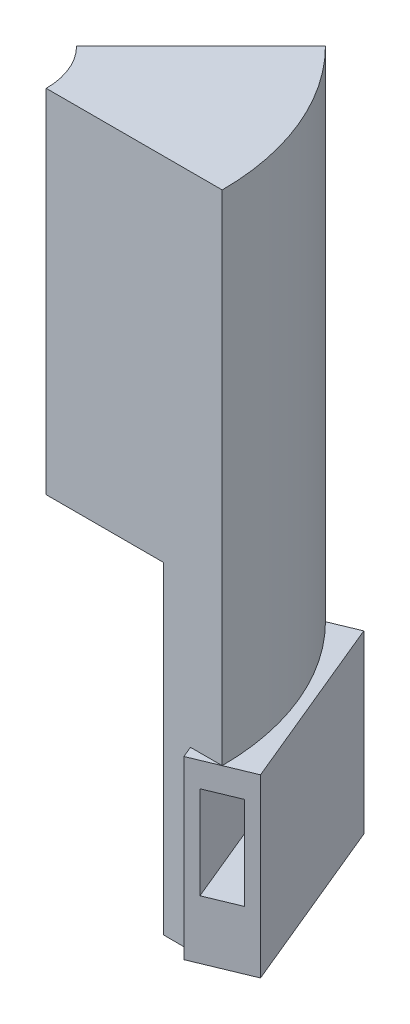
ISO-10303-21;
HEADER;
FILE_DESCRIPTION(('STEP AP214'),'2;1');
FILE_NAME('part.step','',(''),(''),'','','');
FILE_SCHEMA(('AUTOMOTIVE_DESIGN { 1 0 10303 214 1 1 1 1 }'));
ENDSEC;
DATA;
#1=APPLICATION_CONTEXT('core data for automotive mechanical design processes');
#2=APPLICATION_PROTOCOL_DEFINITION('international standard','automotive_design',2000,#1);
#3=PRODUCT_CONTEXT('',#1,'mechanical');
#4=PRODUCT('Part','Part','',(#3));
#5=PRODUCT_RELATED_PRODUCT_CATEGORY('part','',(#4));
#6=PRODUCT_DEFINITION_FORMATION('','',#4);
#7=PRODUCT_DEFINITION_CONTEXT('part definition',#1,'design');
#8=PRODUCT_DEFINITION('design','',#6,#7);
#9=PRODUCT_DEFINITION_SHAPE('','',#8);
#10=(LENGTH_UNIT() NAMED_UNIT(*) SI_UNIT(.MILLI.,.METRE.));
#11=(NAMED_UNIT(*) PLANE_ANGLE_UNIT() SI_UNIT($,.RADIAN.));
#12=(NAMED_UNIT(*) SI_UNIT($,.STERADIAN.) SOLID_ANGLE_UNIT());
#13=UNCERTAINTY_MEASURE_WITH_UNIT(LENGTH_MEASURE(1.E-05),#10,'distance_accuracy_value','');
#14=(GEOMETRIC_REPRESENTATION_CONTEXT(3) GLOBAL_UNCERTAINTY_ASSIGNED_CONTEXT((#13)) GLOBAL_UNIT_ASSIGNED_CONTEXT((#10,
#11,#12)) REPRESENTATION_CONTEXT('',''));
#15=CARTESIAN_POINT('',(0.,0.,0.));
#16=DIRECTION('',(0.,0.,1.));
#17=DIRECTION('',(1.,0.,0.));
#18=AXIS2_PLACEMENT_3D('',#15,#16,#17);
#19=CARTESIAN_POINT('',(10.4809703885628,0.,-22.9809703885628));
#20=DIRECTION('',(0.,-1.,0.));
#21=DIRECTION('',(0.,0.,-1.));
#22=AXIS2_PLACEMENT_3D('',#19,#20,#21);
#23=PLANE('',#22);
#24=CARTESIAN_POINT('',(-12.5,0.,0.));
#25=DIRECTION('',(0.,-1.,0.));
#26=DIRECTION('',(0.,0.,-1.));
#27=AXIS2_PLACEMENT_3D('',#24,#25,#26);
#28=CIRCLE('',#27,12.5);
#29=CARTESIAN_POINT('',(-3.66116523516817,0.,-8.83883476483186));
#30=VERTEX_POINT('',#29);
#31=CARTESIAN_POINT('',(0.,0.,0.));
#32=VERTEX_POINT('',#31);
#33=EDGE_CURVE('E271',#30,#32,#28,.T.);
#34=ORIENTED_EDGE('',*,*,#33,.F.);
#35=DIRECTION('',(0.707106781186546,0.,-0.707106781186549));
#36=VECTOR('',#35,1.);
#37=CARTESIAN_POINT('',(10.4809703885628,0.,-22.9809703885628));
#38=LINE('',#37,#36);
#39=CARTESIAN_POINT('',(10.4809703885628,0.,-22.9809703885628));
#40=VERTEX_POINT('',#39);
#41=EDGE_CURVE('E245',#30,#40,#38,.T.);
#42=ORIENTED_EDGE('',*,*,#41,.T.);
#43=CARTESIAN_POINT('',(-12.5,0.,0.));
#44=DIRECTION('',(0.,-1.,0.));
#45=DIRECTION('',(0.,0.,-1.));
#46=AXIS2_PLACEMENT_3D('',#43,#44,#45);
#47=CIRCLE('',#46,32.5);
#48=CARTESIAN_POINT('',(20.,0.,0.));
#49=VERTEX_POINT('',#48);
#50=EDGE_CURVE('E262',#40,#49,#47,.T.);
#51=ORIENTED_EDGE('',*,*,#50,.T.);
#52=DIRECTION('',(1.,0.,0.));
#53=VECTOR('',#52,1.);
#54=CARTESIAN_POINT('',(20.,0.,0.));
#55=LINE('',#54,#53);
#56=EDGE_CURVE('E228',#32,#49,#55,.T.);
#57=ORIENTED_EDGE('',*,*,#56,.F.);
#58=EDGE_LOOP('',(#34,#42,#51,#57));
#59=FACE_BOUND('',#58,.T.);
#60=ADVANCED_FACE('F38',(#59),#23,.T.);
#61=CARTESIAN_POINT('',(-12.5,0.,0.));
#62=DIRECTION('',(0.,-1.,0.));
#63=DIRECTION('',(0.,0.,-1.));
#64=AXIS2_PLACEMENT_3D('',#61,#62,#63);
#65=CYLINDRICAL_SURFACE('',#64,12.5);
#66=CARTESIAN_POINT('',(-12.5,60.,0.));
#67=DIRECTION('',(0.,-1.,0.));
#68=DIRECTION('',(0.,0.,-1.));
#69=AXIS2_PLACEMENT_3D('',#66,#67,#68);
#70=CIRCLE('',#69,12.5);
#71=CARTESIAN_POINT('',(-3.66116523516817,60.,-8.83883476483186));
#72=VERTEX_POINT('',#71);
#73=CARTESIAN_POINT('',(0.,60.,0.));
#74=VERTEX_POINT('',#73);
#75=EDGE_CURVE('E269',#72,#74,#70,.T.);
#76=ORIENTED_EDGE('',*,*,#75,.F.);
#77=DIRECTION('',(0.,-1.,0.));
#78=VECTOR('',#77,1.);
#79=CARTESIAN_POINT('',(-3.66116523516817,0.,-8.83883476483186));
#80=LINE('',#79,#78);
#81=EDGE_CURVE('E259',#72,#30,#80,.T.);
#82=ORIENTED_EDGE('',*,*,#81,.T.);
#83=ORIENTED_EDGE('',*,*,#33,.T.);
#84=DIRECTION('',(0.,-1.,0.));
#85=VECTOR('',#84,1.);
#86=CARTESIAN_POINT('',(0.,0.,0.));
#87=LINE('',#86,#85);
#88=EDGE_CURVE('E242',#74,#32,#87,.T.);
#89=ORIENTED_EDGE('',*,*,#88,.F.);
#90=EDGE_LOOP('',(#76,#82,#83,#89));
#91=FACE_BOUND('',#90,.T.);
#92=ADVANCED_FACE('F40',(#91),#65,.F.);
#93=CARTESIAN_POINT('',(-3.66116523516817,60.,-8.83883476483186));
#94=DIRECTION('',(0.,1.,0.));
#95=DIRECTION('',(0.,0.,1.));
#96=AXIS2_PLACEMENT_3D('',#93,#94,#95);
#97=PLANE('',#96);
#98=CARTESIAN_POINT('',(-12.5,60.,0.));
#99=DIRECTION('',(0.,-1.,0.));
#100=DIRECTION('',(0.,0.,-1.));
#101=AXIS2_PLACEMENT_3D('',#98,#99,#100);
#102=CIRCLE('',#101,42.5);
#103=CARTESIAN_POINT('',(17.5520382004282,60.,-30.0520382004283));
#104=VERTEX_POINT('',#103);
#105=CARTESIAN_POINT('',(30.,60.,0.));
#106=VERTEX_POINT('',#105);
#107=EDGE_CURVE('E266',#104,#106,#102,.T.);
#108=ORIENTED_EDGE('',*,*,#107,.F.);
#109=DIRECTION('',(-0.707106781186546,0.,0.707106781186549));
#110=VECTOR('',#109,1.);
#111=CARTESIAN_POINT('',(-3.66116523516817,60.,-8.83883476483186));
#112=LINE('',#111,#110);
#113=EDGE_CURVE('E256',#104,#72,#112,.T.);
#114=ORIENTED_EDGE('',*,*,#113,.T.);
#115=ORIENTED_EDGE('',*,*,#75,.T.);
#116=DIRECTION('',(-1.,0.,0.));
#117=VECTOR('',#116,1.);
#118=CARTESIAN_POINT('',(0.,60.,0.));
#119=LINE('',#118,#117);
#120=EDGE_CURVE('E239',#106,#74,#119,.T.);
#121=ORIENTED_EDGE('',*,*,#120,.F.);
#122=EDGE_LOOP('',(#108,#114,#115,#121));
#123=FACE_BOUND('',#122,.T.);
#124=ADVANCED_FACE('F317',(#123),#97,.T.);
#125=CARTESIAN_POINT('',(-12.5,0.,0.));
#126=DIRECTION('',(0.,-1.,0.));
#127=DIRECTION('',(0.,0.,-1.));
#128=AXIS2_PLACEMENT_3D('',#125,#126,#127);
#129=CYLINDRICAL_SURFACE('',#128,42.5);
#130=CARTESIAN_POINT('',(-12.5,-25.,0.));
#131=DIRECTION('',(0.,1.,0.));
#132=DIRECTION('',(0.,0.,1.));
#133=AXIS2_PLACEMENT_3D('',#130,#131,#132);
#134=CIRCLE('',#133,42.5);
#135=CARTESIAN_POINT('',(17.5520382004283,-25.,-30.0520382004284));
#136=VERTEX_POINT('',#135);
#137=CARTESIAN_POINT('',(30.,-25.,0.));
#138=VERTEX_POINT('',#137);
#139=EDGE_CURVE('E224',#136,#138,#134,.F.);
#140=ORIENTED_EDGE('',*,*,#139,.F.);
#141=DIRECTION('',(0.,1.,0.));
#142=VECTOR('',#141,1.);
#143=CARTESIAN_POINT('',(17.5520382004282,60.,-30.0520382004283));
#144=LINE('',#143,#142);
#145=EDGE_CURVE('E254',#136,#104,#144,.T.);
#146=ORIENTED_EDGE('',*,*,#145,.T.);
#147=ORIENTED_EDGE('',*,*,#107,.T.);
#148=DIRECTION('',(0.,1.,0.));
#149=VECTOR('',#148,1.);
#150=CARTESIAN_POINT('',(30.,60.,0.));
#151=LINE('',#150,#149);
#152=EDGE_CURVE('E237',#138,#106,#151,.T.);
#153=ORIENTED_EDGE('',*,*,#152,.F.);
#154=EDGE_LOOP('',(#140,#146,#147,#153));
#155=FACE_BOUND('',#154,.T.);
#156=ADVANCED_FACE('F329',(#155),#129,.T.);
#157=CARTESIAN_POINT('',(17.5520382004282,-55.,-30.0520382004283));
#158=DIRECTION('',(0.,-1.,0.));
#159=DIRECTION('',(0.,0.,-1.));
#160=AXIS2_PLACEMENT_3D('',#157,#158,#159);
#161=PLANE('',#160);
#162=DIRECTION('',(0.707106781186546,0.,-0.707106781186549));
#163=VECTOR('',#162,1.);
#164=CARTESIAN_POINT('',(17.5520382004282,-55.,-30.0520382004283));
#165=LINE('',#164,#163);
#166=CARTESIAN_POINT('',(10.4809703885628,-55.,-22.9809703885628));
#167=VERTEX_POINT('',#166);
#168=CARTESIAN_POINT('',(13.7252038767773,-55.,-26.2252038767774));
#169=VERTEX_POINT('',#168);
#170=EDGE_CURVE('E251',#167,#169,#165,.T.);
#171=ORIENTED_EDGE('',*,*,#170,.T.);
#172=DIRECTION('',(0.382683432365091,0.,0.923879532511286));
#173=VECTOR('',#172,1.);
#174=CARTESIAN_POINT('',(25.3806023374436,-55.,1.91341716182546));
#175=LINE('',#174,#173);
#176=CARTESIAN_POINT('',(12.9326405378718,-55.,-28.1386210386029));
#177=VERTEX_POINT('',#176);
#178=EDGE_CURVE('E191',#177,#169,#175,.T.);
#179=ORIENTED_EDGE('',*,*,#178,.F.);
#180=DIRECTION('',(-0.923879532511287,0.,0.382683432365091));
#181=VECTOR('',#180,1.);
#182=CARTESIAN_POINT('',(22.1714358629846,-55.,-31.9654553622538));
#183=LINE('',#182,#181);
#184=CARTESIAN_POINT('',(22.1714358629846,-55.,-31.9654553622538));
#185=VERTEX_POINT('',#184);
#186=EDGE_CURVE('E214',#185,#177,#183,.T.);
#187=ORIENTED_EDGE('',*,*,#186,.F.);
#188=DIRECTION('',(0.382683432365091,0.,0.923879532511286));
#189=VECTOR('',#188,1.);
#190=CARTESIAN_POINT('',(34.6193976625564,-55.,-1.91341716182545));
#191=LINE('',#190,#189);
#192=CARTESIAN_POINT('',(34.6193976625564,-55.,-1.91341716182545));
#193=VERTEX_POINT('',#192);
#194=EDGE_CURVE('E197',#185,#193,#191,.T.);
#195=ORIENTED_EDGE('',*,*,#194,.T.);
#196=DIRECTION('',(-0.923879532511287,0.,0.382683432365091));
#197=VECTOR('',#196,1.);
#198=CARTESIAN_POINT('',(34.6193976625564,-55.,-1.91341716182545));
#199=LINE('',#198,#197);
#200=CARTESIAN_POINT('',(25.3806023374436,-55.,1.91341716182546));
#201=VERTEX_POINT('',#200);
#202=EDGE_CURVE('E211',#193,#201,#199,.T.);
#203=ORIENTED_EDGE('',*,*,#202,.T.);
#204=CARTESIAN_POINT('',(24.588038998538,-55.,0.));
#205=VERTEX_POINT('',#204);
#206=EDGE_CURVE('E209',#205,#201,#175,.T.);
#207=ORIENTED_EDGE('',*,*,#206,.F.);
#208=DIRECTION('',(1.,0.,0.));
#209=VECTOR('',#208,1.);
#210=CARTESIAN_POINT('',(30.,-55.,0.));
#211=LINE('',#210,#209);
#212=CARTESIAN_POINT('',(20.,-55.,0.));
#213=VERTEX_POINT('',#212);
#214=EDGE_CURVE('E234',#213,#205,#211,.T.);
#215=ORIENTED_EDGE('',*,*,#214,.F.);
#216=CARTESIAN_POINT('',(-12.5,-55.,0.));
#217=DIRECTION('',(0.,-1.,0.));
#218=DIRECTION('',(0.,0.,-1.));
#219=AXIS2_PLACEMENT_3D('',#216,#217,#218);
#220=CIRCLE('',#219,32.5);
#221=EDGE_CURVE('E264',#167,#213,#220,.T.);
#222=ORIENTED_EDGE('',*,*,#221,.F.);
#223=EDGE_LOOP('',(#171,#179,#187,#195,#203,#207,#215,#222));
#224=FACE_BOUND('',#223,.T.);
#225=ADVANCED_FACE('F285',(#224),#161,.T.);
#226=CARTESIAN_POINT('',(-12.5,0.,0.));
#227=DIRECTION('',(0.,-1.,0.));
#228=DIRECTION('',(0.,0.,-1.));
#229=AXIS2_PLACEMENT_3D('',#226,#227,#228);
#230=CYLINDRICAL_SURFACE('',#229,32.5);
#231=DIRECTION('',(0.,-1.,0.));
#232=VECTOR('',#231,1.);
#233=CARTESIAN_POINT('',(10.4809703885628,-55.,-22.9809703885628));
#234=LINE('',#233,#232);
#235=EDGE_CURVE('E248',#40,#167,#234,.T.);
#236=ORIENTED_EDGE('',*,*,#235,.T.);
#237=ORIENTED_EDGE('',*,*,#221,.T.);
#238=DIRECTION('',(0.,-1.,0.));
#239=VECTOR('',#238,1.);
#240=CARTESIAN_POINT('',(20.,-55.,0.));
#241=LINE('',#240,#239);
#242=EDGE_CURVE('E231',#49,#213,#241,.T.);
#243=ORIENTED_EDGE('',*,*,#242,.F.);
#244=ORIENTED_EDGE('',*,*,#50,.F.);
#245=EDGE_LOOP('',(#236,#237,#243,#244));
#246=FACE_BOUND('',#245,.T.);
#247=ADVANCED_FACE('F323',(#246),#230,.F.);
#248=CARTESIAN_POINT('',(-3.66116523516817,0.,-8.83883476483186));
#249=DIRECTION('',(-0.707106781186549,0.,-0.707106781186546));
#250=DIRECTION('',(-0.707106781186546,0.,0.707106781186549));
#251=AXIS2_PLACEMENT_3D('',#248,#249,#250);
#252=PLANE('',#251);
#253=DIRECTION('',(0.707106781186546,0.,-0.707106781186549));
#254=VECTOR('',#253,1.);
#255=CARTESIAN_POINT('',(-3.66116523516817,-25.,-8.83883476483186));
#256=LINE('',#255,#254);
#257=CARTESIAN_POINT('',(13.7252038767773,-25.,-26.2252038767774));
#258=VERTEX_POINT('',#257);
#259=EDGE_CURVE('E226',#258,#136,#256,.T.);
#260=ORIENTED_EDGE('',*,*,#259,.F.);
#261=DIRECTION('',(0.,1.,0.));
#262=VECTOR('',#261,1.);
#263=CARTESIAN_POINT('',(13.7252038767773,0.,-26.2252038767774));
#264=LINE('',#263,#262);
#265=EDGE_CURVE('E213',#169,#258,#264,.T.);
#266=ORIENTED_EDGE('',*,*,#265,.F.);
#267=ORIENTED_EDGE('',*,*,#170,.F.);
#268=ORIENTED_EDGE('',*,*,#235,.F.);
#269=ORIENTED_EDGE('',*,*,#41,.F.);
#270=ORIENTED_EDGE('',*,*,#81,.F.);
#271=ORIENTED_EDGE('',*,*,#113,.F.);
#272=ORIENTED_EDGE('',*,*,#145,.F.);
#273=EDGE_LOOP('',(#260,#266,#267,#268,#269,#270,#271,#272));
#274=FACE_BOUND('',#273,.T.);
#275=ADVANCED_FACE('F321',(#274),#252,.T.);
#276=CARTESIAN_POINT('',(0.,0.,0.));
#277=DIRECTION('',(0.,0.,-1.));
#278=DIRECTION('',(-1.,0.,0.));
#279=AXIS2_PLACEMENT_3D('',#276,#277,#278);
#280=PLANE('',#279);
#281=DIRECTION('',(0.,1.,0.));
#282=VECTOR('',#281,1.);
#283=CARTESIAN_POINT('',(24.588038998538,0.,0.));
#284=LINE('',#283,#282);
#285=CARTESIAN_POINT('',(24.588038998538,-25.,0.));
#286=VERTEX_POINT('',#285);
#287=EDGE_CURVE('E46',#205,#286,#284,.T.);
#288=ORIENTED_EDGE('',*,*,#287,.T.);
#289=DIRECTION('',(1.,0.,0.));
#290=VECTOR('',#289,1.);
#291=CARTESIAN_POINT('',(0.,-25.,0.));
#292=LINE('',#291,#290);
#293=EDGE_CURVE('E11',#286,#138,#292,.T.);
#294=ORIENTED_EDGE('',*,*,#293,.T.);
#295=ORIENTED_EDGE('',*,*,#152,.T.);
#296=ORIENTED_EDGE('',*,*,#120,.T.);
#297=ORIENTED_EDGE('',*,*,#88,.T.);
#298=ORIENTED_EDGE('',*,*,#56,.T.);
#299=ORIENTED_EDGE('',*,*,#242,.T.);
#300=ORIENTED_EDGE('',*,*,#214,.T.);
#301=EDGE_LOOP('',(#288,#294,#295,#296,#297,#298,#299,#300));
#302=FACE_BOUND('',#301,.T.);
#303=ADVANCED_FACE('F274',(#302),#280,.F.);
#304=CARTESIAN_POINT('',(22.1714358629846,-55.,-31.9654553622538));
#305=DIRECTION('',(-0.382683432365091,0.,-0.923879532511287));
#306=DIRECTION('',(-0.923879532511287,0.,0.382683432365091));
#307=AXIS2_PLACEMENT_3D('',#304,#305,#306);
#308=PLANE('',#307);
#309=DIRECTION('',(0.,-1.,0.));
#310=VECTOR('',#309,1.);
#311=CARTESIAN_POINT('',(20.2312888447109,-55.,-31.1618201542871));
#312=LINE('',#311,#310);
#313=CARTESIAN_POINT('',(20.2312888447109,-29.2,-31.1618201542871));
#314=VERTEX_POINT('',#313);
#315=CARTESIAN_POINT('',(20.2312888447109,-45.,-31.1618201542871));
#316=VERTEX_POINT('',#315);
#317=EDGE_CURVE('E184',#314,#316,#312,.T.);
#318=ORIENTED_EDGE('',*,*,#317,.F.);
#319=DIRECTION('',(0.923879532511287,0.,-0.382683432365091));
#320=VECTOR('',#319,1.);
#321=CARTESIAN_POINT('',(22.1714358629846,-29.2,-31.9654553622538));
#322=LINE('',#321,#320);
#323=CARTESIAN_POINT('',(14.8727875561455,-29.2,-28.9422562465696));
#324=VERTEX_POINT('',#323);
#325=EDGE_CURVE('E177',#324,#314,#322,.T.);
#326=ORIENTED_EDGE('',*,*,#325,.F.);
#327=DIRECTION('',(0.,1.,0.));
#328=VECTOR('',#327,1.);
#329=CARTESIAN_POINT('',(14.8727875561455,-55.,-28.9422562465696));
#330=LINE('',#329,#328);
#331=CARTESIAN_POINT('',(14.8727875561455,-45.,-28.9422562465696));
#332=VERTEX_POINT('',#331);
#333=EDGE_CURVE('E157',#332,#324,#330,.T.);
#334=ORIENTED_EDGE('',*,*,#333,.F.);
#335=DIRECTION('',(-0.923879532511287,0.,0.382683432365091));
#336=VECTOR('',#335,1.);
#337=CARTESIAN_POINT('',(22.1714358629846,-45.,-31.9654553622538));
#338=LINE('',#337,#336);
#339=EDGE_CURVE('E182',#316,#332,#338,.T.);
#340=ORIENTED_EDGE('',*,*,#339,.F.);
#341=EDGE_LOOP('',(#318,#326,#334,#340));
#342=FACE_BOUND('',#341,.T.);
#343=ORIENTED_EDGE('',*,*,#186,.T.);
#344=DIRECTION('',(0.,-1.,0.));
#345=VECTOR('',#344,1.);
#346=CARTESIAN_POINT('',(12.9326405378718,-55.,-28.1386210386029));
#347=LINE('',#346,#345);
#348=CARTESIAN_POINT('',(12.9326405378718,-25.,-28.1386210386029));
#349=VERTEX_POINT('',#348);
#350=EDGE_CURVE('E206',#349,#177,#347,.T.);
#351=ORIENTED_EDGE('',*,*,#350,.F.);
#352=DIRECTION('',(-0.923879532511287,0.,0.382683432365091));
#353=VECTOR('',#352,1.);
#354=CARTESIAN_POINT('',(22.1714358629846,-25.,-31.9654553622538));
#355=LINE('',#354,#353);
#356=EDGE_CURVE('E219',#136,#349,#355,.T.);
#357=ORIENTED_EDGE('',*,*,#356,.F.);
#358=CARTESIAN_POINT('',(22.1714358629846,-25.,-31.9654553622538));
#359=VERTEX_POINT('',#358);
#360=EDGE_CURVE('E216',#359,#136,#355,.T.);
#361=ORIENTED_EDGE('',*,*,#360,.F.);
#362=DIRECTION('',(0.,-1.,0.));
#363=VECTOR('',#362,1.);
#364=CARTESIAN_POINT('',(22.1714358629846,-55.,-31.9654553622538));
#365=LINE('',#364,#363);
#366=EDGE_CURVE('E194',#359,#185,#365,.T.);
#367=ORIENTED_EDGE('',*,*,#366,.T.);
#368=EDGE_LOOP('',(#343,#351,#357,#361,#367));
#369=FACE_BOUND('',#368,.T.);
#370=ADVANCED_FACE('F357',(#342,#369),#308,.T.);
#371=CARTESIAN_POINT('',(34.6193976625564,-55.,-1.91341716182545));
#372=DIRECTION('',(0.382683432365091,0.,0.923879532511287));
#373=DIRECTION('',(0.923879532511287,0.,-0.382683432365091));
#374=AXIS2_PLACEMENT_3D('',#371,#372,#373);
#375=PLANE('',#374);
#376=DIRECTION('',(0.,1.,0.));
#377=VECTOR('',#376,1.);
#378=CARTESIAN_POINT('',(32.6792506442827,-29.2,-1.10978195385876));
#379=LINE('',#378,#377);
#380=CARTESIAN_POINT('',(32.6792506442827,-45.,-1.10978195385876));
#381=VERTEX_POINT('',#380);
#382=CARTESIAN_POINT('',(32.6792506442827,-29.2,-1.10978195385876));
#383=VERTEX_POINT('',#382);
#384=EDGE_CURVE('E61',#381,#383,#379,.T.);
#385=ORIENTED_EDGE('',*,*,#384,.F.);
#386=DIRECTION('',(0.923879532511286,0.,-0.382683432365091));
#387=VECTOR('',#386,1.);
#388=CARTESIAN_POINT('',(27.3207493557173,-45.,1.10978195385877));
#389=LINE('',#388,#387);
#390=CARTESIAN_POINT('',(27.3207493557173,-45.,1.10978195385877));
#391=VERTEX_POINT('',#390);
#392=EDGE_CURVE('E170',#391,#381,#389,.T.);
#393=ORIENTED_EDGE('',*,*,#392,.F.);
#394=DIRECTION('',(0.,-1.,0.));
#395=VECTOR('',#394,1.);
#396=CARTESIAN_POINT('',(27.3207493557173,-29.2,1.10978195385877));
#397=LINE('',#396,#395);
#398=CARTESIAN_POINT('',(27.3207493557173,-29.2,1.10978195385877));
#399=VERTEX_POINT('',#398);
#400=EDGE_CURVE('E154',#399,#391,#397,.T.);
#401=ORIENTED_EDGE('',*,*,#400,.F.);
#402=DIRECTION('',(-0.923879532511286,0.,0.382683432365091));
#403=VECTOR('',#402,1.);
#404=CARTESIAN_POINT('',(27.3207493557173,-29.2,1.10978195385877));
#405=LINE('',#404,#403);
#406=EDGE_CURVE('E163',#383,#399,#405,.T.);
#407=ORIENTED_EDGE('',*,*,#406,.F.);
#408=EDGE_LOOP('',(#385,#393,#401,#407));
#409=FACE_BOUND('',#408,.T.);
#410=ORIENTED_EDGE('',*,*,#202,.F.);
#411=DIRECTION('',(0.,1.,0.));
#412=VECTOR('',#411,1.);
#413=CARTESIAN_POINT('',(34.6193976625564,-55.,-1.91341716182545));
#414=LINE('',#413,#412);
#415=CARTESIAN_POINT('',(34.6193976625564,-25.,-1.91341716182545));
#416=VERTEX_POINT('',#415);
#417=EDGE_CURVE('E187',#193,#416,#414,.T.);
#418=ORIENTED_EDGE('',*,*,#417,.T.);
#419=DIRECTION('',(-0.923879532511287,0.,0.382683432365091));
#420=VECTOR('',#419,1.);
#421=CARTESIAN_POINT('',(34.6193976625564,-25.,-1.91341716182545));
#422=LINE('',#421,#420);
#423=EDGE_CURVE('E220',#416,#138,#422,.T.);
#424=ORIENTED_EDGE('',*,*,#423,.T.);
#425=CARTESIAN_POINT('',(25.3806023374436,-25.,1.91341716182546));
#426=VERTEX_POINT('',#425);
#427=EDGE_CURVE('E200',#138,#426,#422,.T.);
#428=ORIENTED_EDGE('',*,*,#427,.T.);
#429=DIRECTION('',(0.,1.,0.));
#430=VECTOR('',#429,1.);
#431=CARTESIAN_POINT('',(25.3806023374436,-55.,1.91341716182546));
#432=LINE('',#431,#430);
#433=EDGE_CURVE('E186',#201,#426,#432,.T.);
#434=ORIENTED_EDGE('',*,*,#433,.F.);
#435=EDGE_LOOP('',(#410,#418,#424,#428,#434));
#436=FACE_BOUND('',#435,.T.);
#437=ADVANCED_FACE('F167',(#409,#436),#375,.T.);
#438=CARTESIAN_POINT('',(34.6193976625564,-25.,-1.91341716182545));
#439=DIRECTION('',(0.,1.,0.));
#440=DIRECTION('',(0.,0.,1.));
#441=AXIS2_PLACEMENT_3D('',#438,#439,#440);
#442=PLANE('',#441);
#443=DIRECTION('',(-0.382683432365091,0.,-0.923879532511286));
#444=VECTOR('',#443,1.);
#445=CARTESIAN_POINT('',(25.3806023374436,-25.,1.91341716182546));
#446=LINE('',#445,#444);
#447=EDGE_CURVE('E203',#258,#349,#446,.T.);
#448=ORIENTED_EDGE('',*,*,#447,.F.);
#449=ORIENTED_EDGE('',*,*,#259,.T.);
#450=ORIENTED_EDGE('',*,*,#356,.T.);
#451=EDGE_LOOP('',(#448,#449,#450));
#452=FACE_BOUND('',#451,.T.);
#453=ADVANCED_FACE('F299',(#452),#442,.T.);
#454=ORIENTED_EDGE('',*,*,#293,.F.);
#455=EDGE_CURVE('E204',#426,#286,#446,.T.);
#456=ORIENTED_EDGE('',*,*,#455,.F.);
#457=ORIENTED_EDGE('',*,*,#427,.F.);
#458=EDGE_LOOP('',(#454,#456,#457));
#459=FACE_BOUND('',#458,.T.);
#460=ADVANCED_FACE('F297',(#459),#442,.T.);
#461=CARTESIAN_POINT('',(20.9872040552418,0.,-8.69318455597278));
#462=DIRECTION('',(-0.923879532511287,0.,0.382683432365091));
#463=DIRECTION('',(0.382683432365091,0.,0.923879532511286));
#464=AXIS2_PLACEMENT_3D('',#461,#462,#463);
#465=PLANE('',#464);
#466=ORIENTED_EDGE('',*,*,#287,.F.);
#467=ORIENTED_EDGE('',*,*,#206,.T.);
#468=ORIENTED_EDGE('',*,*,#433,.T.);
#469=ORIENTED_EDGE('',*,*,#455,.T.);
#470=EDGE_LOOP('',(#466,#467,#468,#469));
#471=FACE_BOUND('',#470,.T.);
#472=ADVANCED_FACE('F281',(#471),#465,.T.);
#473=ORIENTED_EDGE('',*,*,#360,.T.);
#474=ORIENTED_EDGE('',*,*,#139,.T.);
#475=ORIENTED_EDGE('',*,*,#423,.F.);
#476=DIRECTION('',(-0.382683432365091,0.,-0.923879532511286));
#477=VECTOR('',#476,1.);
#478=CARTESIAN_POINT('',(34.6193976625564,-25.,-1.91341716182545));
#479=LINE('',#478,#477);
#480=EDGE_CURVE('E190',#416,#359,#479,.T.);
#481=ORIENTED_EDGE('',*,*,#480,.T.);
#482=EDGE_LOOP('',(#473,#474,#475,#481));
#483=FACE_BOUND('',#482,.T.);
#484=ADVANCED_FACE('F293',(#483),#442,.T.);
#485=CARTESIAN_POINT('',(30.2259993803546,0.,-12.5200188796237));
#486=DIRECTION('',(-0.923879532511287,0.,0.382683432365091));
#487=DIRECTION('',(0.382683432365091,0.,0.923879532511286));
#488=AXIS2_PLACEMENT_3D('',#485,#486,#487);
#489=PLANE('',#488);
#490=ORIENTED_EDGE('',*,*,#417,.F.);
#491=ORIENTED_EDGE('',*,*,#194,.F.);
#492=ORIENTED_EDGE('',*,*,#366,.F.);
#493=ORIENTED_EDGE('',*,*,#480,.F.);
#494=EDGE_LOOP('',(#490,#491,#492,#493));
#495=FACE_BOUND('',#494,.T.);
#496=ADVANCED_FACE('F290',(#495),#489,.F.);
#497=ORIENTED_EDGE('',*,*,#178,.T.);
#498=ORIENTED_EDGE('',*,*,#265,.T.);
#499=ORIENTED_EDGE('',*,*,#447,.T.);
#500=ORIENTED_EDGE('',*,*,#350,.T.);
#501=EDGE_LOOP('',(#497,#498,#499,#500));
#502=FACE_BOUND('',#501,.T.);
#503=ADVANCED_FACE('F306',(#502),#465,.T.);
#504=CARTESIAN_POINT('',(16.44819200173,-29.2,-40.2950238603826));
#505=DIRECTION('',(0.923879532511287,0.,-0.382683432365091));
#506=DIRECTION('',(-0.382683432365091,0.,-0.923879532511287));
#507=AXIS2_PLACEMENT_3D('',#504,#505,#506);
#508=PLANE('',#507);
#509=ORIENTED_EDGE('',*,*,#317,.T.);
#510=DIRECTION('',(0.382683432365091,0.,0.923879532511287));
#511=VECTOR('',#510,1.);
#512=CARTESIAN_POINT('',(16.44819200173,-45.,-40.2950238603826));
#513=LINE('',#512,#511);
#514=EDGE_CURVE('E175',#316,#381,#513,.T.);
#515=ORIENTED_EDGE('',*,*,#514,.T.);
#516=ORIENTED_EDGE('',*,*,#384,.T.);
#517=DIRECTION('',(0.382683432365091,0.,0.923879532511287));
#518=VECTOR('',#517,1.);
#519=CARTESIAN_POINT('',(16.44819200173,-29.2,-40.2950238603826));
#520=LINE('',#519,#518);
#521=EDGE_CURVE('E160',#314,#383,#520,.T.);
#522=ORIENTED_EDGE('',*,*,#521,.F.);
#523=EDGE_LOOP('',(#509,#515,#516,#522));
#524=FACE_BOUND('',#523,.T.);
#525=ADVANCED_FACE('F367',(#524),#508,.F.);
#526=CARTESIAN_POINT('',(11.0896907131645,-45.,-38.075459952665));
#527=DIRECTION('',(0.,-1.,0.));
#528=DIRECTION('',(0.,0.,-1.));
#529=AXIS2_PLACEMENT_3D('',#526,#527,#528);
#530=PLANE('',#529);
#531=ORIENTED_EDGE('',*,*,#339,.T.);
#532=DIRECTION('',(0.382683432365091,0.,0.923879532511287));
#533=VECTOR('',#532,1.);
#534=CARTESIAN_POINT('',(11.0896907131645,-45.,-38.075459952665));
#535=LINE('',#534,#533);
#536=EDGE_CURVE('E159',#332,#391,#535,.T.);
#537=ORIENTED_EDGE('',*,*,#536,.T.);
#538=ORIENTED_EDGE('',*,*,#392,.T.);
#539=ORIENTED_EDGE('',*,*,#514,.F.);
#540=EDGE_LOOP('',(#531,#537,#538,#539));
#541=FACE_BOUND('',#540,.T.);
#542=ADVANCED_FACE('F372',(#541),#530,.F.);
#543=CARTESIAN_POINT('',(11.0896907131645,-29.2,-38.075459952665));
#544=DIRECTION('',(-0.923879532511287,0.,0.382683432365091));
#545=DIRECTION('',(0.382683432365091,0.,0.923879532511287));
#546=AXIS2_PLACEMENT_3D('',#543,#544,#545);
#547=PLANE('',#546);
#548=ORIENTED_EDGE('',*,*,#333,.T.);
#549=DIRECTION('',(0.382683432365091,0.,0.923879532511287));
#550=VECTOR('',#549,1.);
#551=CARTESIAN_POINT('',(11.0896907131645,-29.2,-38.075459952665));
#552=LINE('',#551,#550);
#553=EDGE_CURVE('E53',#324,#399,#552,.T.);
#554=ORIENTED_EDGE('',*,*,#553,.T.);
#555=ORIENTED_EDGE('',*,*,#400,.T.);
#556=ORIENTED_EDGE('',*,*,#536,.F.);
#557=EDGE_LOOP('',(#548,#554,#555,#556));
#558=FACE_BOUND('',#557,.T.);
#559=ADVANCED_FACE('F151',(#558),#547,.F.);
#560=CARTESIAN_POINT('',(11.0896907131645,-29.2,-38.075459952665));
#561=DIRECTION('',(0.,1.,0.));
#562=DIRECTION('',(0.,0.,1.));
#563=AXIS2_PLACEMENT_3D('',#560,#561,#562);
#564=PLANE('',#563);
#565=ORIENTED_EDGE('',*,*,#325,.T.);
#566=ORIENTED_EDGE('',*,*,#521,.T.);
#567=ORIENTED_EDGE('',*,*,#406,.T.);
#568=ORIENTED_EDGE('',*,*,#553,.F.);
#569=EDGE_LOOP('',(#565,#566,#567,#568));
#570=FACE_BOUND('',#569,.T.);
#571=ADVANCED_FACE('F164',(#570),#564,.F.);
#572=CLOSED_SHELL('',(#60,#92,#124,#156,#225,#247,#275,#303,#370,#437,#453,#460,#472,#484,#496,
#503,#525,#542,#559,#571));
#573=MANIFOLD_SOLID_BREP('B2',#572);
#574=ADVANCED_BREP_SHAPE_REPRESENTATION('',(#18,#573),#14);
#575=SHAPE_DEFINITION_REPRESENTATION(#9,#574);
ENDSEC;
END-ISO-10303-21;
